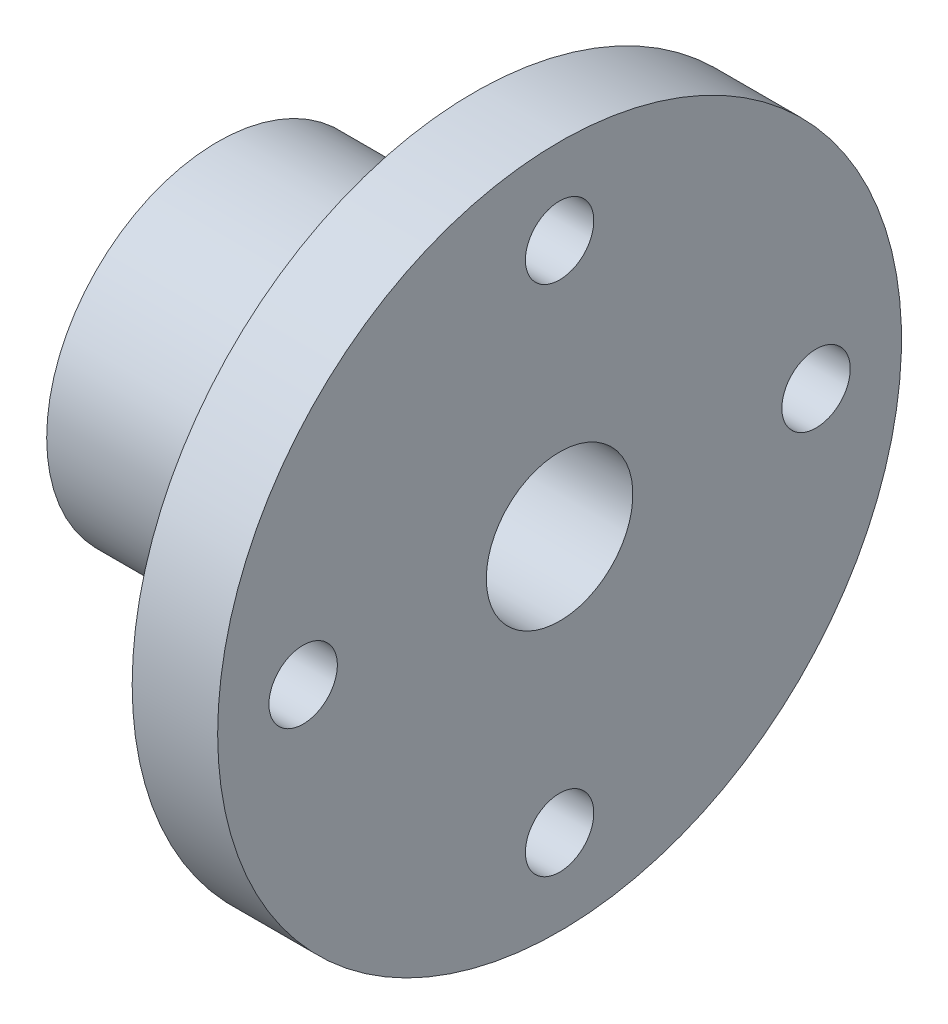
ISO-10303-21;
HEADER;
FILE_DESCRIPTION(('STEP AP214'),'2;1');
FILE_NAME('part.step','',(''),(''),'','','');
FILE_SCHEMA(('AUTOMOTIVE_DESIGN { 1 0 10303 214 1 1 1 1 }'));
ENDSEC;
DATA;
#1=APPLICATION_CONTEXT('core data for automotive mechanical design processes');
#2=APPLICATION_PROTOCOL_DEFINITION('international standard','automotive_design',2000,#1);
#3=PRODUCT_CONTEXT('',#1,'mechanical');
#4=PRODUCT('Part','Part','',(#3));
#5=PRODUCT_RELATED_PRODUCT_CATEGORY('part','',(#4));
#6=PRODUCT_DEFINITION_FORMATION('','',#4);
#7=PRODUCT_DEFINITION_CONTEXT('part definition',#1,'design');
#8=PRODUCT_DEFINITION('design','',#6,#7);
#9=PRODUCT_DEFINITION_SHAPE('','',#8);
#10=(LENGTH_UNIT() NAMED_UNIT(*) SI_UNIT(.MILLI.,.METRE.));
#11=(NAMED_UNIT(*) PLANE_ANGLE_UNIT() SI_UNIT($,.RADIAN.));
#12=(NAMED_UNIT(*) SI_UNIT($,.STERADIAN.) SOLID_ANGLE_UNIT());
#13=UNCERTAINTY_MEASURE_WITH_UNIT(LENGTH_MEASURE(1.E-05),#10,'distance_accuracy_value','');
#14=(GEOMETRIC_REPRESENTATION_CONTEXT(3) GLOBAL_UNCERTAINTY_ASSIGNED_CONTEXT((#13)) GLOBAL_UNIT_ASSIGNED_CONTEXT((#10,
#11,#12)) REPRESENTATION_CONTEXT('',''));
#15=CARTESIAN_POINT('',(0.,0.,0.));
#16=DIRECTION('',(0.,0.,1.));
#17=DIRECTION('',(1.,0.,0.));
#18=AXIS2_PLACEMENT_3D('',#15,#16,#17);
#19=CARTESIAN_POINT('',(12.0833333333333,0.,8.4));
#20=DIRECTION('',(-1.,0.,0.));
#21=DIRECTION('',(0.,0.,1.));
#22=AXIS2_PLACEMENT_3D('',#19,#20,#21);
#23=PLANE('',#22);
#24=CARTESIAN_POINT('',(12.0833333333333,0.,0.));
#25=DIRECTION('',(-1.,0.,0.));
#26=DIRECTION('',(0.,0.,1.));
#27=AXIS2_PLACEMENT_3D('',#24,#25,#26);
#28=CIRCLE('',#27,12.);
#29=CARTESIAN_POINT('',(12.0833333333333,0.,12.));
#30=VERTEX_POINT('',#29);
#31=EDGE_CURVE('E85',#30,#30,#28,.T.);
#32=ORIENTED_EDGE('',*,*,#31,.T.);
#33=EDGE_LOOP('',(#32));
#34=FACE_BOUND('',#33,.T.);
#35=CARTESIAN_POINT('',(12.0833333333333,0.,-42.));
#36=DIRECTION('',(-1.,0.,0.));
#37=DIRECTION('',(0.,0.,1.));
#38=AXIS2_PLACEMENT_3D('',#35,#36,#37);
#39=CIRCLE('',#38,5.6);
#40=CARTESIAN_POINT('',(12.0833333333333,0.,-36.4));
#41=VERTEX_POINT('',#40);
#42=EDGE_CURVE('E71',#41,#41,#39,.F.);
#43=ORIENTED_EDGE('',*,*,#42,.F.);
#44=EDGE_LOOP('',(#43));
#45=FACE_BOUND('',#44,.T.);
#46=CARTESIAN_POINT('',(12.0833333333333,0.,42.));
#47=DIRECTION('',(-1.,0.,0.));
#48=DIRECTION('',(0.,0.,1.));
#49=AXIS2_PLACEMENT_3D('',#46,#47,#48);
#50=CIRCLE('',#49,5.6);
#51=CARTESIAN_POINT('',(12.0833333333333,0.,47.6));
#52=VERTEX_POINT('',#51);
#53=EDGE_CURVE('E57',#52,#52,#50,.F.);
#54=ORIENTED_EDGE('',*,*,#53,.F.);
#55=EDGE_LOOP('',(#54));
#56=FACE_BOUND('',#55,.T.);
#57=CARTESIAN_POINT('',(12.0833333333333,0.,0.));
#58=DIRECTION('',(-1.,0.,0.));
#59=DIRECTION('',(0.,0.,1.));
#60=AXIS2_PLACEMENT_3D('',#57,#58,#59);
#61=CIRCLE('',#60,56.);
#62=CARTESIAN_POINT('',(12.0833333333333,0.,56.));
#63=VERTEX_POINT('',#62);
#64=EDGE_CURVE('E10',#63,#63,#61,.T.);
#65=ORIENTED_EDGE('',*,*,#64,.F.);
#66=EDGE_LOOP('',(#65));
#67=FACE_BOUND('',#66,.T.);
#68=CARTESIAN_POINT('',(12.0833333333333,-42.,0.));
#69=DIRECTION('',(-1.,0.,0.));
#70=DIRECTION('',(0.,0.,1.));
#71=AXIS2_PLACEMENT_3D('',#68,#69,#70);
#72=CIRCLE('',#71,5.6);
#73=CARTESIAN_POINT('',(12.0833333333333,-42.,5.6));
#74=VERTEX_POINT('',#73);
#75=EDGE_CURVE('E64',#74,#74,#72,.F.);
#76=ORIENTED_EDGE('',*,*,#75,.F.);
#77=EDGE_LOOP('',(#76));
#78=FACE_BOUND('',#77,.T.);
#79=CARTESIAN_POINT('',(12.0833333333333,42.,0.));
#80=DIRECTION('',(-1.,0.,0.));
#81=DIRECTION('',(0.,0.,1.));
#82=AXIS2_PLACEMENT_3D('',#79,#80,#81);
#83=CIRCLE('',#82,5.6);
#84=CARTESIAN_POINT('',(12.0833333333333,42.,5.6));
#85=VERTEX_POINT('',#84);
#86=EDGE_CURVE('E78',#85,#85,#83,.F.);
#87=ORIENTED_EDGE('',*,*,#86,.F.);
#88=EDGE_LOOP('',(#87));
#89=FACE_BOUND('',#88,.T.);
#90=ADVANCED_FACE('F38',(#34,#45,#56,#67,#78,#89),#23,.F.);
#91=CARTESIAN_POINT('',(-1.91666666666668,0.,56.));
#92=DIRECTION('',(1.,0.,0.));
#93=DIRECTION('',(0.,0.,-1.));
#94=AXIS2_PLACEMENT_3D('',#91,#92,#93);
#95=PLANE('',#94);
#96=CARTESIAN_POINT('',(-1.91666666666668,0.,-42.));
#97=DIRECTION('',(1.,0.,0.));
#98=DIRECTION('',(0.,1.,0.));
#99=AXIS2_PLACEMENT_3D('',#96,#97,#98);
#100=CIRCLE('',#99,5.6);
#101=CARTESIAN_POINT('',(-1.91666666666668,5.6,-42.));
#102=VERTEX_POINT('',#101);
#103=EDGE_CURVE('E74',#102,#102,#100,.T.);
#104=ORIENTED_EDGE('',*,*,#103,.T.);
#105=EDGE_LOOP('',(#104));
#106=FACE_BOUND('',#105,.T.);
#107=CARTESIAN_POINT('',(-1.91666666666668,0.,42.));
#108=DIRECTION('',(1.,0.,0.));
#109=DIRECTION('',(0.,-1.,0.));
#110=AXIS2_PLACEMENT_3D('',#107,#108,#109);
#111=CIRCLE('',#110,5.6);
#112=CARTESIAN_POINT('',(-1.91666666666668,-5.6,42.));
#113=VERTEX_POINT('',#112);
#114=EDGE_CURVE('E60',#113,#113,#111,.T.);
#115=ORIENTED_EDGE('',*,*,#114,.T.);
#116=EDGE_LOOP('',(#115));
#117=FACE_BOUND('',#116,.T.);
#118=CARTESIAN_POINT('',(-1.91666666666668,0.,0.));
#119=DIRECTION('',(-1.,0.,0.));
#120=DIRECTION('',(0.,0.,1.));
#121=AXIS2_PLACEMENT_3D('',#118,#119,#120);
#122=CIRCLE('',#121,28.);
#123=CARTESIAN_POINT('',(-1.91666666666668,0.,28.));
#124=VERTEX_POINT('',#123);
#125=EDGE_CURVE('E48',#124,#124,#122,.T.);
#126=ORIENTED_EDGE('',*,*,#125,.F.);
#127=EDGE_LOOP('',(#126));
#128=FACE_BOUND('',#127,.T.);
#129=CARTESIAN_POINT('',(-1.91666666666668,0.,0.));
#130=DIRECTION('',(-1.,0.,0.));
#131=DIRECTION('',(0.,0.,1.));
#132=AXIS2_PLACEMENT_3D('',#129,#130,#131);
#133=CIRCLE('',#132,56.);
#134=CARTESIAN_POINT('',(-1.91666666666668,0.,56.));
#135=VERTEX_POINT('',#134);
#136=EDGE_CURVE('E44',#135,#135,#133,.T.);
#137=ORIENTED_EDGE('',*,*,#136,.T.);
#138=EDGE_LOOP('',(#137));
#139=FACE_BOUND('',#138,.T.);
#140=CARTESIAN_POINT('',(-1.91666666666668,-42.,0.));
#141=DIRECTION('',(1.,0.,0.));
#142=DIRECTION('',(0.,0.,-1.));
#143=AXIS2_PLACEMENT_3D('',#140,#141,#142);
#144=CIRCLE('',#143,5.6);
#145=CARTESIAN_POINT('',(-1.91666666666668,-42.,-5.6));
#146=VERTEX_POINT('',#145);
#147=EDGE_CURVE('E67',#146,#146,#144,.T.);
#148=ORIENTED_EDGE('',*,*,#147,.T.);
#149=EDGE_LOOP('',(#148));
#150=FACE_BOUND('',#149,.T.);
#151=CARTESIAN_POINT('',(-1.91666666666668,42.,0.));
#152=DIRECTION('',(1.,0.,0.));
#153=DIRECTION('',(0.,0.,1.));
#154=AXIS2_PLACEMENT_3D('',#151,#152,#153);
#155=CIRCLE('',#154,5.6);
#156=CARTESIAN_POINT('',(-1.91666666666668,42.,5.6));
#157=VERTEX_POINT('',#156);
#158=EDGE_CURVE('E81',#157,#157,#155,.T.);
#159=ORIENTED_EDGE('',*,*,#158,.T.);
#160=EDGE_LOOP('',(#159));
#161=FACE_BOUND('',#160,.T.);
#162=ADVANCED_FACE('F115',(#106,#117,#128,#139,#150,#161),#95,.F.);
#163=CARTESIAN_POINT('',(-155.916666666667,0.,0.));
#164=DIRECTION('',(-1.,0.,0.));
#165=DIRECTION('',(0.,0.,1.));
#166=AXIS2_PLACEMENT_3D('',#163,#164,#165);
#167=CYLINDRICAL_SURFACE('',#166,56.);
#168=ORIENTED_EDGE('',*,*,#136,.F.);
#169=EDGE_LOOP('',(#168));
#170=FACE_BOUND('',#169,.T.);
#171=ORIENTED_EDGE('',*,*,#64,.T.);
#172=EDGE_LOOP('',(#171));
#173=FACE_BOUND('',#172,.T.);
#174=ADVANCED_FACE('F111',(#170,#173),#167,.T.);
#175=CARTESIAN_POINT('',(-155.916666666667,0.,0.));
#176=DIRECTION('',(-1.,0.,0.));
#177=DIRECTION('',(0.,0.,1.));
#178=AXIS2_PLACEMENT_3D('',#175,#176,#177);
#179=CYLINDRICAL_SURFACE('',#178,28.);
#180=CARTESIAN_POINT('',(-43.9166666666667,0.,0.));
#181=DIRECTION('',(-1.,0.,0.));
#182=DIRECTION('',(0.,0.,1.));
#183=AXIS2_PLACEMENT_3D('',#180,#181,#182);
#184=CIRCLE('',#183,28.);
#185=CARTESIAN_POINT('',(-43.9166666666667,0.,28.));
#186=VERTEX_POINT('',#185);
#187=EDGE_CURVE('E52',#186,#186,#184,.T.);
#188=ORIENTED_EDGE('',*,*,#187,.F.);
#189=EDGE_LOOP('',(#188));
#190=FACE_BOUND('',#189,.T.);
#191=ORIENTED_EDGE('',*,*,#125,.T.);
#192=EDGE_LOOP('',(#191));
#193=FACE_BOUND('',#192,.T.);
#194=ADVANCED_FACE('F105',(#190,#193),#179,.T.);
#195=CARTESIAN_POINT('',(-43.9166666666667,0.,28.));
#196=DIRECTION('',(1.,0.,0.));
#197=DIRECTION('',(0.,0.,-1.));
#198=AXIS2_PLACEMENT_3D('',#195,#196,#197);
#199=PLANE('',#198);
#200=CARTESIAN_POINT('',(-43.9166666666667,0.,0.));
#201=DIRECTION('',(-1.,0.,0.));
#202=DIRECTION('',(0.,0.,1.));
#203=AXIS2_PLACEMENT_3D('',#200,#201,#202);
#204=CIRCLE('',#203,12.);
#205=CARTESIAN_POINT('',(-43.9166666666667,0.,12.));
#206=VERTEX_POINT('',#205);
#207=EDGE_CURVE('E86',#206,#206,#204,.T.);
#208=ORIENTED_EDGE('',*,*,#207,.F.);
#209=EDGE_LOOP('',(#208));
#210=FACE_BOUND('',#209,.T.);
#211=ORIENTED_EDGE('',*,*,#187,.T.);
#212=EDGE_LOOP('',(#211));
#213=FACE_BOUND('',#212,.T.);
#214=ADVANCED_FACE('F101',(#210,#213),#199,.F.);
#215=CARTESIAN_POINT('',(131.433333333333,0.,42.));
#216=DIRECTION('',(-1.,0.,0.));
#217=DIRECTION('',(0.,0.,1.));
#218=AXIS2_PLACEMENT_3D('',#215,#216,#217);
#219=CYLINDRICAL_SURFACE('',#218,5.6);
#220=ORIENTED_EDGE('',*,*,#114,.F.);
#221=EDGE_LOOP('',(#220));
#222=FACE_BOUND('',#221,.T.);
#223=ORIENTED_EDGE('',*,*,#53,.T.);
#224=EDGE_LOOP('',(#223));
#225=FACE_BOUND('',#224,.T.);
#226=ADVANCED_FACE('F104',(#222,#225),#219,.F.);
#227=CARTESIAN_POINT('',(131.433333333333,-42.,0.));
#228=DIRECTION('',(-1.,0.,0.));
#229=DIRECTION('',(0.,0.,1.));
#230=AXIS2_PLACEMENT_3D('',#227,#228,#229);
#231=CYLINDRICAL_SURFACE('',#230,5.6);
#232=ORIENTED_EDGE('',*,*,#147,.F.);
#233=EDGE_LOOP('',(#232));
#234=FACE_BOUND('',#233,.T.);
#235=ORIENTED_EDGE('',*,*,#75,.T.);
#236=EDGE_LOOP('',(#235));
#237=FACE_BOUND('',#236,.T.);
#238=ADVANCED_FACE('F167',(#234,#237),#231,.F.);
#239=CARTESIAN_POINT('',(131.433333333333,0.,-42.));
#240=DIRECTION('',(-1.,0.,0.));
#241=DIRECTION('',(0.,0.,1.));
#242=AXIS2_PLACEMENT_3D('',#239,#240,#241);
#243=CYLINDRICAL_SURFACE('',#242,5.6);
#244=ORIENTED_EDGE('',*,*,#103,.F.);
#245=EDGE_LOOP('',(#244));
#246=FACE_BOUND('',#245,.T.);
#247=ORIENTED_EDGE('',*,*,#42,.T.);
#248=EDGE_LOOP('',(#247));
#249=FACE_BOUND('',#248,.T.);
#250=ADVANCED_FACE('F126',(#246,#249),#243,.F.);
#251=CARTESIAN_POINT('',(131.433333333333,42.,0.));
#252=DIRECTION('',(-1.,0.,0.));
#253=DIRECTION('',(0.,0.,1.));
#254=AXIS2_PLACEMENT_3D('',#251,#252,#253);
#255=CYLINDRICAL_SURFACE('',#254,5.6);
#256=ORIENTED_EDGE('',*,*,#158,.F.);
#257=EDGE_LOOP('',(#256));
#258=FACE_BOUND('',#257,.T.);
#259=ORIENTED_EDGE('',*,*,#86,.T.);
#260=EDGE_LOOP('',(#259));
#261=FACE_BOUND('',#260,.T.);
#262=ADVANCED_FACE('F97',(#258,#261),#255,.F.);
#263=CARTESIAN_POINT('',(12.0833333333333,0.,0.));
#264=DIRECTION('',(-1.,0.,0.));
#265=DIRECTION('',(0.,0.,1.));
#266=AXIS2_PLACEMENT_3D('',#263,#264,#265);
#267=CYLINDRICAL_SURFACE('',#266,12.);
#268=ORIENTED_EDGE('',*,*,#31,.F.);
#269=EDGE_LOOP('',(#268));
#270=FACE_BOUND('',#269,.T.);
#271=ORIENTED_EDGE('',*,*,#207,.T.);
#272=EDGE_LOOP('',(#271));
#273=FACE_BOUND('',#272,.T.);
#274=ADVANCED_FACE('F94',(#270,#273),#267,.F.);
#275=CLOSED_SHELL('',(#90,#162,#174,#194,#214,#226,#238,#250,#262,#274));
#276=MANIFOLD_SOLID_BREP('B2',#275);
#277=ADVANCED_BREP_SHAPE_REPRESENTATION('',(#18,#276),#14);
#278=SHAPE_DEFINITION_REPRESENTATION(#9,#277);
ENDSEC;
END-ISO-10303-21;
